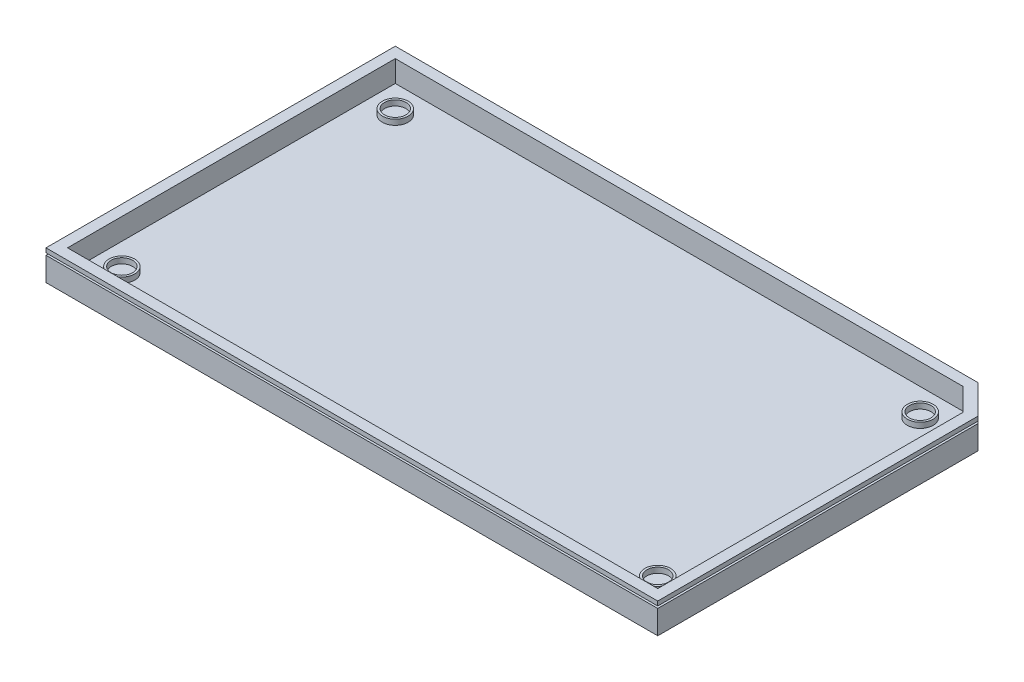
ISO-10303-21;
HEADER;
FILE_DESCRIPTION(('STEP AP214'),'2;1');
FILE_NAME('part.step','',(''),(''),'','','');
FILE_SCHEMA(('AUTOMOTIVE_DESIGN { 1 0 10303 214 1 1 1 1 }'));
ENDSEC;
DATA;
#1=APPLICATION_CONTEXT('core data for automotive mechanical design processes');
#2=APPLICATION_PROTOCOL_DEFINITION('international standard','automotive_design',2000,#1);
#3=PRODUCT_CONTEXT('',#1,'mechanical');
#4=PRODUCT('Part','Part','',(#3));
#5=PRODUCT_RELATED_PRODUCT_CATEGORY('part','',(#4));
#6=PRODUCT_DEFINITION_FORMATION('','',#4);
#7=PRODUCT_DEFINITION_CONTEXT('part definition',#1,'design');
#8=PRODUCT_DEFINITION('design','',#6,#7);
#9=PRODUCT_DEFINITION_SHAPE('','',#8);
#10=(LENGTH_UNIT() NAMED_UNIT(*) SI_UNIT(.MILLI.,.METRE.));
#11=(NAMED_UNIT(*) PLANE_ANGLE_UNIT() SI_UNIT($,.RADIAN.));
#12=(NAMED_UNIT(*) SI_UNIT($,.STERADIAN.) SOLID_ANGLE_UNIT());
#13=UNCERTAINTY_MEASURE_WITH_UNIT(LENGTH_MEASURE(1.E-05),#10,'distance_accuracy_value','');
#14=(GEOMETRIC_REPRESENTATION_CONTEXT(3) GLOBAL_UNCERTAINTY_ASSIGNED_CONTEXT((#13)) GLOBAL_UNIT_ASSIGNED_CONTEXT((#10,
#11,#12)) REPRESENTATION_CONTEXT('',''));
#15=CARTESIAN_POINT('',(0.,0.,0.));
#16=DIRECTION('',(0.,0.,1.));
#17=DIRECTION('',(1.,0.,0.));
#18=AXIS2_PLACEMENT_3D('',#15,#16,#17);
#19=CARTESIAN_POINT('',(64.135,1.25,31.75));
#20=DIRECTION('',(0.,1.,0.));
#21=DIRECTION('',(0.,0.,1.));
#22=AXIS2_PLACEMENT_3D('',#19,#20,#21);
#23=PLANE('',#22);
#24=CARTESIAN_POINT('',(64.135,1.25,31.75));
#25=DIRECTION('',(0.,1.,0.));
#26=DIRECTION('',(0.,0.,1.));
#27=AXIS2_PLACEMENT_3D('',#24,#25,#26);
#28=CIRCLE('',#27,3.00000000000001);
#29=CARTESIAN_POINT('',(64.135,1.25,34.75));
#30=VERTEX_POINT('',#29);
#31=EDGE_CURVE('E11',#30,#30,#28,.T.);
#32=ORIENTED_EDGE('',*,*,#31,.T.);
#33=EDGE_LOOP('',(#32));
#34=FACE_BOUND('',#33,.T.);
#35=CARTESIAN_POINT('',(64.135,1.25,31.75));
#36=DIRECTION('',(0.,1.,0.));
#37=DIRECTION('',(0.,0.,1.));
#38=AXIS2_PLACEMENT_3D('',#35,#36,#37);
#39=CIRCLE('',#38,2.50000000000001);
#40=CARTESIAN_POINT('',(64.135,1.25,34.25));
#41=VERTEX_POINT('',#40);
#42=EDGE_CURVE('E51',#41,#41,#39,.T.);
#43=ORIENTED_EDGE('',*,*,#42,.F.);
#44=EDGE_LOOP('',(#43));
#45=FACE_BOUND('',#44,.T.);
#46=ADVANCED_FACE('F40',(#34,#45),#23,.T.);
#47=CARTESIAN_POINT('',(64.135,0.,31.75));
#48=DIRECTION('',(0.,1.,0.));
#49=DIRECTION('',(0.,0.,1.));
#50=AXIS2_PLACEMENT_3D('',#47,#48,#49);
#51=PLANE('',#50);
#52=CARTESIAN_POINT('',(64.135,0.,31.75));
#53=DIRECTION('',(0.,1.,0.));
#54=DIRECTION('',(0.,0.,1.));
#55=AXIS2_PLACEMENT_3D('',#52,#53,#54);
#56=CIRCLE('',#55,3.00000000000001);
#57=CARTESIAN_POINT('',(64.135,0.,34.75));
#58=VERTEX_POINT('',#57);
#59=EDGE_CURVE('E44',#58,#58,#56,.T.);
#60=ORIENTED_EDGE('',*,*,#59,.F.);
#61=EDGE_LOOP('',(#60));
#62=FACE_BOUND('',#61,.T.);
#63=CARTESIAN_POINT('',(64.135,0.,31.75));
#64=DIRECTION('',(0.,1.,0.));
#65=DIRECTION('',(0.,0.,1.));
#66=AXIS2_PLACEMENT_3D('',#63,#64,#65);
#67=CIRCLE('',#66,2.50000000000001);
#68=CARTESIAN_POINT('',(64.135,0.,34.25));
#69=VERTEX_POINT('',#68);
#70=EDGE_CURVE('E53',#69,#69,#67,.T.);
#71=ORIENTED_EDGE('',*,*,#70,.T.);
#72=EDGE_LOOP('',(#71));
#73=FACE_BOUND('',#72,.T.);
#74=ADVANCED_FACE('F63',(#62,#73),#51,.F.);
#75=CARTESIAN_POINT('',(64.135,1.25,31.75));
#76=DIRECTION('',(0.,-1.,0.));
#77=DIRECTION('',(0.,0.,-1.));
#78=AXIS2_PLACEMENT_3D('',#75,#76,#77);
#79=CYLINDRICAL_SURFACE('',#78,3.00000000000001);
#80=ORIENTED_EDGE('',*,*,#31,.F.);
#81=EDGE_LOOP('',(#80));
#82=FACE_BOUND('',#81,.T.);
#83=ORIENTED_EDGE('',*,*,#59,.T.);
#84=EDGE_LOOP('',(#83));
#85=FACE_BOUND('',#84,.T.);
#86=ADVANCED_FACE('F42',(#82,#85),#79,.T.);
#87=CARTESIAN_POINT('',(64.135,1.25,31.75));
#88=DIRECTION('',(0.,-1.,0.));
#89=DIRECTION('',(0.,0.,-1.));
#90=AXIS2_PLACEMENT_3D('',#87,#88,#89);
#91=CYLINDRICAL_SURFACE('',#90,2.50000000000001);
#92=ORIENTED_EDGE('',*,*,#42,.T.);
#93=EDGE_LOOP('',(#92));
#94=FACE_BOUND('',#93,.T.);
#95=ORIENTED_EDGE('',*,*,#70,.F.);
#96=EDGE_LOOP('',(#95));
#97=FACE_BOUND('',#96,.T.);
#98=ADVANCED_FACE('F59',(#94,#97),#91,.F.);
#99=CLOSED_SHELL('',(#46,#74,#86,#98));
#100=MANIFOLD_SOLID_BREP('B2',#99);
#101=CARTESIAN_POINT('',(61.595,1.25,-31.75));
#102=DIRECTION('',(0.,1.,0.));
#103=DIRECTION('',(0.,0.,1.));
#104=AXIS2_PLACEMENT_3D('',#101,#102,#103);
#105=PLANE('',#104);
#106=CARTESIAN_POINT('',(61.595,1.25,-31.75));
#107=DIRECTION('',(0.,1.,0.));
#108=DIRECTION('',(0.,0.,1.));
#109=AXIS2_PLACEMENT_3D('',#106,#107,#108);
#110=CIRCLE('',#109,3.);
#111=CARTESIAN_POINT('',(61.595,1.25,-28.75));
#112=VERTEX_POINT('',#111);
#113=EDGE_CURVE('E39',#112,#112,#110,.T.);
#114=ORIENTED_EDGE('',*,*,#113,.T.);
#115=EDGE_LOOP('',(#114));
#116=FACE_BOUND('',#115,.T.);
#117=CARTESIAN_POINT('',(61.595,1.25,-31.75));
#118=DIRECTION('',(0.,1.,0.));
#119=DIRECTION('',(0.,0.,1.));
#120=AXIS2_PLACEMENT_3D('',#117,#118,#119);
#121=CIRCLE('',#120,2.5);
#122=CARTESIAN_POINT('',(61.595,1.25,-29.25));
#123=VERTEX_POINT('',#122);
#124=EDGE_CURVE('E121',#123,#123,#121,.T.);
#125=ORIENTED_EDGE('',*,*,#124,.F.);
#126=EDGE_LOOP('',(#125));
#127=FACE_BOUND('',#126,.T.);
#128=ADVANCED_FACE('F110',(#116,#127),#105,.T.);
#129=CARTESIAN_POINT('',(61.595,0.,-31.75));
#130=DIRECTION('',(0.,1.,0.));
#131=DIRECTION('',(0.,0.,1.));
#132=AXIS2_PLACEMENT_3D('',#129,#130,#131);
#133=PLANE('',#132);
#134=CARTESIAN_POINT('',(61.595,0.,-31.75));
#135=DIRECTION('',(0.,1.,0.));
#136=DIRECTION('',(0.,0.,1.));
#137=AXIS2_PLACEMENT_3D('',#134,#135,#136);
#138=CIRCLE('',#137,3.);
#139=CARTESIAN_POINT('',(61.595,0.,-28.75));
#140=VERTEX_POINT('',#139);
#141=EDGE_CURVE('E114',#140,#140,#138,.T.);
#142=ORIENTED_EDGE('',*,*,#141,.F.);
#143=EDGE_LOOP('',(#142));
#144=FACE_BOUND('',#143,.T.);
#145=CARTESIAN_POINT('',(61.595,0.,-31.75));
#146=DIRECTION('',(0.,1.,0.));
#147=DIRECTION('',(0.,0.,1.));
#148=AXIS2_PLACEMENT_3D('',#145,#146,#147);
#149=CIRCLE('',#148,2.5);
#150=CARTESIAN_POINT('',(61.595,0.,-29.25));
#151=VERTEX_POINT('',#150);
#152=EDGE_CURVE('E123',#151,#151,#149,.T.);
#153=ORIENTED_EDGE('',*,*,#152,.T.);
#154=EDGE_LOOP('',(#153));
#155=FACE_BOUND('',#154,.T.);
#156=ADVANCED_FACE('F133',(#144,#155),#133,.F.);
#157=CARTESIAN_POINT('',(61.595,1.25,-31.75));
#158=DIRECTION('',(0.,-1.,0.));
#159=DIRECTION('',(0.,0.,-1.));
#160=AXIS2_PLACEMENT_3D('',#157,#158,#159);
#161=CYLINDRICAL_SURFACE('',#160,3.);
#162=ORIENTED_EDGE('',*,*,#113,.F.);
#163=EDGE_LOOP('',(#162));
#164=FACE_BOUND('',#163,.T.);
#165=ORIENTED_EDGE('',*,*,#141,.T.);
#166=EDGE_LOOP('',(#165));
#167=FACE_BOUND('',#166,.T.);
#168=ADVANCED_FACE('F112',(#164,#167),#161,.T.);
#169=CARTESIAN_POINT('',(61.595,1.25,-31.75));
#170=DIRECTION('',(0.,-1.,0.));
#171=DIRECTION('',(0.,0.,-1.));
#172=AXIS2_PLACEMENT_3D('',#169,#170,#171);
#173=CYLINDRICAL_SURFACE('',#172,2.5);
#174=ORIENTED_EDGE('',*,*,#124,.T.);
#175=EDGE_LOOP('',(#174));
#176=FACE_BOUND('',#175,.T.);
#177=ORIENTED_EDGE('',*,*,#152,.F.);
#178=EDGE_LOOP('',(#177));
#179=FACE_BOUND('',#178,.T.);
#180=ADVANCED_FACE('F129',(#176,#179),#173,.F.);
#181=CLOSED_SHELL('',(#128,#156,#168,#180));
#182=MANIFOLD_SOLID_BREP('B6',#181);
#183=CARTESIAN_POINT('',(-60.325,1.25,-31.75));
#184=DIRECTION('',(0.,1.,0.));
#185=DIRECTION('',(0.,0.,1.));
#186=AXIS2_PLACEMENT_3D('',#183,#184,#185);
#187=PLANE('',#186);
#188=CARTESIAN_POINT('',(-60.325,1.25,-31.75));
#189=DIRECTION('',(0.,1.,0.));
#190=DIRECTION('',(0.,0.,1.));
#191=AXIS2_PLACEMENT_3D('',#188,#189,#190);
#192=CIRCLE('',#191,3.);
#193=CARTESIAN_POINT('',(-60.325,1.25,-28.75));
#194=VERTEX_POINT('',#193);
#195=EDGE_CURVE('E109',#194,#194,#192,.T.);
#196=ORIENTED_EDGE('',*,*,#195,.T.);
#197=EDGE_LOOP('',(#196));
#198=FACE_BOUND('',#197,.T.);
#199=CARTESIAN_POINT('',(-60.325,1.25,-31.75));
#200=DIRECTION('',(0.,1.,0.));
#201=DIRECTION('',(0.,0.,1.));
#202=AXIS2_PLACEMENT_3D('',#199,#200,#201);
#203=CIRCLE('',#202,2.50000000000001);
#204=CARTESIAN_POINT('',(-60.325,1.25,-29.25));
#205=VERTEX_POINT('',#204);
#206=EDGE_CURVE('E191',#205,#205,#203,.T.);
#207=ORIENTED_EDGE('',*,*,#206,.F.);
#208=EDGE_LOOP('',(#207));
#209=FACE_BOUND('',#208,.T.);
#210=ADVANCED_FACE('F180',(#198,#209),#187,.T.);
#211=CARTESIAN_POINT('',(-60.325,0.,-31.75));
#212=DIRECTION('',(0.,1.,0.));
#213=DIRECTION('',(0.,0.,1.));
#214=AXIS2_PLACEMENT_3D('',#211,#212,#213);
#215=PLANE('',#214);
#216=CARTESIAN_POINT('',(-60.325,0.,-31.75));
#217=DIRECTION('',(0.,1.,0.));
#218=DIRECTION('',(0.,0.,1.));
#219=AXIS2_PLACEMENT_3D('',#216,#217,#218);
#220=CIRCLE('',#219,3.);
#221=CARTESIAN_POINT('',(-60.325,0.,-28.75));
#222=VERTEX_POINT('',#221);
#223=EDGE_CURVE('E184',#222,#222,#220,.T.);
#224=ORIENTED_EDGE('',*,*,#223,.F.);
#225=EDGE_LOOP('',(#224));
#226=FACE_BOUND('',#225,.T.);
#227=CARTESIAN_POINT('',(-60.325,0.,-31.75));
#228=DIRECTION('',(0.,1.,0.));
#229=DIRECTION('',(0.,0.,1.));
#230=AXIS2_PLACEMENT_3D('',#227,#228,#229);
#231=CIRCLE('',#230,2.50000000000001);
#232=CARTESIAN_POINT('',(-60.325,0.,-29.25));
#233=VERTEX_POINT('',#232);
#234=EDGE_CURVE('E193',#233,#233,#231,.T.);
#235=ORIENTED_EDGE('',*,*,#234,.T.);
#236=EDGE_LOOP('',(#235));
#237=FACE_BOUND('',#236,.T.);
#238=ADVANCED_FACE('F203',(#226,#237),#215,.F.);
#239=CARTESIAN_POINT('',(-60.325,1.25,-31.75));
#240=DIRECTION('',(0.,-1.,0.));
#241=DIRECTION('',(0.,0.,-1.));
#242=AXIS2_PLACEMENT_3D('',#239,#240,#241);
#243=CYLINDRICAL_SURFACE('',#242,3.);
#244=ORIENTED_EDGE('',*,*,#195,.F.);
#245=EDGE_LOOP('',(#244));
#246=FACE_BOUND('',#245,.T.);
#247=ORIENTED_EDGE('',*,*,#223,.T.);
#248=EDGE_LOOP('',(#247));
#249=FACE_BOUND('',#248,.T.);
#250=ADVANCED_FACE('F182',(#246,#249),#243,.T.);
#251=CARTESIAN_POINT('',(-60.325,1.25,-31.75));
#252=DIRECTION('',(0.,-1.,0.));
#253=DIRECTION('',(0.,0.,-1.));
#254=AXIS2_PLACEMENT_3D('',#251,#252,#253);
#255=CYLINDRICAL_SURFACE('',#254,2.50000000000001);
#256=ORIENTED_EDGE('',*,*,#206,.T.);
#257=EDGE_LOOP('',(#256));
#258=FACE_BOUND('',#257,.T.);
#259=ORIENTED_EDGE('',*,*,#234,.F.);
#260=EDGE_LOOP('',(#259));
#261=FACE_BOUND('',#260,.T.);
#262=ADVANCED_FACE('F199',(#258,#261),#255,.F.);
#263=CLOSED_SHELL('',(#210,#238,#250,#262));
#264=MANIFOLD_SOLID_BREP('B34',#263);
#265=CARTESIAN_POINT('',(-60.325,1.25,31.75));
#266=DIRECTION('',(0.,1.,0.));
#267=DIRECTION('',(0.,0.,1.));
#268=AXIS2_PLACEMENT_3D('',#265,#266,#267);
#269=PLANE('',#268);
#270=CARTESIAN_POINT('',(-60.325,1.25,31.75));
#271=DIRECTION('',(0.,1.,0.));
#272=DIRECTION('',(0.,0.,1.));
#273=AXIS2_PLACEMENT_3D('',#270,#271,#272);
#274=CIRCLE('',#273,3.);
#275=CARTESIAN_POINT('',(-60.325,1.25,34.75));
#276=VERTEX_POINT('',#275);
#277=EDGE_CURVE('E179',#276,#276,#274,.T.);
#278=ORIENTED_EDGE('',*,*,#277,.T.);
#279=EDGE_LOOP('',(#278));
#280=FACE_BOUND('',#279,.T.);
#281=CARTESIAN_POINT('',(-60.325,1.25,31.75));
#282=DIRECTION('',(0.,1.,0.));
#283=DIRECTION('',(0.,0.,1.));
#284=AXIS2_PLACEMENT_3D('',#281,#282,#283);
#285=CIRCLE('',#284,2.5);
#286=CARTESIAN_POINT('',(-60.325,1.25,34.25));
#287=VERTEX_POINT('',#286);
#288=EDGE_CURVE('E262',#287,#287,#285,.T.);
#289=ORIENTED_EDGE('',*,*,#288,.F.);
#290=EDGE_LOOP('',(#289));
#291=FACE_BOUND('',#290,.T.);
#292=ADVANCED_FACE('F251',(#280,#291),#269,.T.);
#293=CARTESIAN_POINT('',(-60.325,0.,31.75));
#294=DIRECTION('',(0.,1.,0.));
#295=DIRECTION('',(0.,0.,1.));
#296=AXIS2_PLACEMENT_3D('',#293,#294,#295);
#297=PLANE('',#296);
#298=CARTESIAN_POINT('',(-60.325,0.,31.75));
#299=DIRECTION('',(0.,1.,0.));
#300=DIRECTION('',(0.,0.,1.));
#301=AXIS2_PLACEMENT_3D('',#298,#299,#300);
#302=CIRCLE('',#301,3.);
#303=CARTESIAN_POINT('',(-60.325,0.,34.75));
#304=VERTEX_POINT('',#303);
#305=EDGE_CURVE('E255',#304,#304,#302,.T.);
#306=ORIENTED_EDGE('',*,*,#305,.F.);
#307=EDGE_LOOP('',(#306));
#308=FACE_BOUND('',#307,.T.);
#309=CARTESIAN_POINT('',(-60.325,0.,31.75));
#310=DIRECTION('',(0.,1.,0.));
#311=DIRECTION('',(0.,0.,1.));
#312=AXIS2_PLACEMENT_3D('',#309,#310,#311);
#313=CIRCLE('',#312,2.5);
#314=CARTESIAN_POINT('',(-60.325,0.,34.25));
#315=VERTEX_POINT('',#314);
#316=EDGE_CURVE('E264',#315,#315,#313,.T.);
#317=ORIENTED_EDGE('',*,*,#316,.T.);
#318=EDGE_LOOP('',(#317));
#319=FACE_BOUND('',#318,.T.);
#320=ADVANCED_FACE('F274',(#308,#319),#297,.F.);
#321=CARTESIAN_POINT('',(-60.325,1.25,31.75));
#322=DIRECTION('',(0.,-1.,0.));
#323=DIRECTION('',(0.,0.,-1.));
#324=AXIS2_PLACEMENT_3D('',#321,#322,#323);
#325=CYLINDRICAL_SURFACE('',#324,3.);
#326=ORIENTED_EDGE('',*,*,#277,.F.);
#327=EDGE_LOOP('',(#326));
#328=FACE_BOUND('',#327,.T.);
#329=ORIENTED_EDGE('',*,*,#305,.T.);
#330=EDGE_LOOP('',(#329));
#331=FACE_BOUND('',#330,.T.);
#332=ADVANCED_FACE('F253',(#328,#331),#325,.T.);
#333=CARTESIAN_POINT('',(-60.325,1.25,31.75));
#334=DIRECTION('',(0.,-1.,0.));
#335=DIRECTION('',(0.,0.,-1.));
#336=AXIS2_PLACEMENT_3D('',#333,#334,#335);
#337=CYLINDRICAL_SURFACE('',#336,2.5);
#338=ORIENTED_EDGE('',*,*,#288,.T.);
#339=EDGE_LOOP('',(#338));
#340=FACE_BOUND('',#339,.T.);
#341=ORIENTED_EDGE('',*,*,#316,.F.);
#342=EDGE_LOOP('',(#341));
#343=FACE_BOUND('',#342,.T.);
#344=ADVANCED_FACE('F270',(#340,#343),#337,.F.);
#345=CLOSED_SHELL('',(#292,#320,#332,#344));
#346=MANIFOLD_SOLID_BREP('B104',#345);
#347=CARTESIAN_POINT('',(0.,5.,0.));
#348=DIRECTION('',(0.,1.,0.));
#349=DIRECTION('',(0.,0.,1.));
#350=AXIS2_PLACEMENT_3D('',#347,#348,#349);
#351=PLANE('',#350);
#352=DIRECTION('',(0.,0.,-1.));
#353=VECTOR('',#352,1.);
#354=CARTESIAN_POINT('',(72.945,5.,40.56));
#355=LINE('',#354,#353);
#356=CARTESIAN_POINT('',(72.945,5.,40.56));
#357=VERTEX_POINT('',#356);
#358=CARTESIAN_POINT('',(72.945,5.,-33.8210678118655));
#359=VERTEX_POINT('',#358);
#360=EDGE_CURVE('E554',#357,#359,#355,.T.);
#361=ORIENTED_EDGE('',*,*,#360,.T.);
#362=DIRECTION('',(-0.707106781186548,0.,-0.707106781186547));
#363=VECTOR('',#362,1.);
#364=CARTESIAN_POINT('',(72.945,5.,-33.8210678118655));
#365=LINE('',#364,#363);
#366=CARTESIAN_POINT('',(66.2060678118655,5.,-40.56));
#367=VERTEX_POINT('',#366);
#368=EDGE_CURVE('E557',#359,#367,#365,.T.);
#369=ORIENTED_EDGE('',*,*,#368,.T.);
#370=DIRECTION('',(-1.,0.,0.));
#371=VECTOR('',#370,1.);
#372=CARTESIAN_POINT('',(66.2060678118655,5.,-40.56));
#373=LINE('',#372,#371);
#374=CARTESIAN_POINT('',(-69.135,5.,-40.56));
#375=VERTEX_POINT('',#374);
#376=EDGE_CURVE('E560',#367,#375,#373,.T.);
#377=ORIENTED_EDGE('',*,*,#376,.T.);
#378=DIRECTION('',(0.,0.,1.));
#379=VECTOR('',#378,1.);
#380=CARTESIAN_POINT('',(-69.135,5.,-40.56));
#381=LINE('',#380,#379);
#382=CARTESIAN_POINT('',(-69.135,5.,40.56));
#383=VERTEX_POINT('',#382);
#384=EDGE_CURVE('E563',#375,#383,#381,.T.);
#385=ORIENTED_EDGE('',*,*,#384,.T.);
#386=DIRECTION('',(1.,0.,0.));
#387=VECTOR('',#386,1.);
#388=CARTESIAN_POINT('',(-69.135,5.,40.56));
#389=LINE('',#388,#387);
#390=EDGE_CURVE('E566',#383,#357,#389,.T.);
#391=ORIENTED_EDGE('',*,*,#390,.T.);
#392=EDGE_LOOP('',(#361,#369,#377,#385,#391));
#393=FACE_BOUND('',#392,.T.);
#394=DIRECTION('',(1.,0.,0.));
#395=VECTOR('',#394,1.);
#396=CARTESIAN_POINT('',(-66.635,5.,38.06));
#397=LINE('',#396,#395);
#398=CARTESIAN_POINT('',(-66.635,5.,38.06));
#399=VERTEX_POINT('',#398);
#400=CARTESIAN_POINT('',(70.445,5.,38.06));
#401=VERTEX_POINT('',#400);
#402=EDGE_CURVE('E520',#399,#401,#397,.T.);
#403=ORIENTED_EDGE('',*,*,#402,.F.);
#404=DIRECTION('',(0.,0.,1.));
#405=VECTOR('',#404,1.);
#406=CARTESIAN_POINT('',(-66.635,5.,-38.06));
#407=LINE('',#406,#405);
#408=CARTESIAN_POINT('',(-66.635,5.,-38.06));
#409=VERTEX_POINT('',#408);
#410=EDGE_CURVE('E518',#409,#399,#407,.T.);
#411=ORIENTED_EDGE('',*,*,#410,.F.);
#412=DIRECTION('',(-1.,0.,0.));
#413=VECTOR('',#412,1.);
#414=CARTESIAN_POINT('',(65.1705339059328,5.,-38.06));
#415=LINE('',#414,#413);
#416=CARTESIAN_POINT('',(65.1705339059328,5.,-38.06));
#417=VERTEX_POINT('',#416);
#418=EDGE_CURVE('E528',#417,#409,#415,.T.);
#419=ORIENTED_EDGE('',*,*,#418,.F.);
#420=DIRECTION('',(-0.707106781186547,0.,-0.707106781186547));
#421=VECTOR('',#420,1.);
#422=CARTESIAN_POINT('',(70.445,5.,-32.7855339059328));
#423=LINE('',#422,#421);
#424=CARTESIAN_POINT('',(70.445,5.,-32.7855339059328));
#425=VERTEX_POINT('',#424);
#426=EDGE_CURVE('E525',#425,#417,#423,.T.);
#427=ORIENTED_EDGE('',*,*,#426,.F.);
#428=DIRECTION('',(0.,0.,-1.));
#429=VECTOR('',#428,1.);
#430=CARTESIAN_POINT('',(70.445,5.,38.06));
#431=LINE('',#430,#429);
#432=EDGE_CURVE('E523',#401,#425,#431,.T.);
#433=ORIENTED_EDGE('',*,*,#432,.F.);
#434=EDGE_LOOP('',(#403,#411,#419,#427,#433));
#435=FACE_BOUND('',#434,.T.);
#436=ADVANCED_FACE('F313',(#393,#435),#351,.T.);
#437=CARTESIAN_POINT('',(72.945,-2.,40.56));
#438=DIRECTION('',(1.,0.,0.));
#439=DIRECTION('',(0.,0.,-1.));
#440=AXIS2_PLACEMENT_3D('',#437,#438,#439);
#441=PLANE('',#440);
#442=DIRECTION('',(0.,0.,1.));
#443=VECTOR('',#442,1.);
#444=CARTESIAN_POINT('',(72.945,4.,40.56));
#445=LINE('',#444,#443);
#446=CARTESIAN_POINT('',(72.945,4.,-33.8210678118655));
#447=VERTEX_POINT('',#446);
#448=CARTESIAN_POINT('',(72.945,4.,40.56));
#449=VERTEX_POINT('',#448);
#450=EDGE_CURVE('E505',#447,#449,#445,.T.);
#451=ORIENTED_EDGE('',*,*,#450,.F.);
#452=DIRECTION('',(0.,1.,0.));
#453=VECTOR('',#452,1.);
#454=CARTESIAN_POINT('',(72.945,-2.,-33.8210678118655));
#455=LINE('',#454,#453);
#456=EDGE_CURVE('E584',#447,#359,#455,.T.);
#457=ORIENTED_EDGE('',*,*,#456,.T.);
#458=ORIENTED_EDGE('',*,*,#360,.F.);
#459=DIRECTION('',(0.,1.,0.));
#460=VECTOR('',#459,1.);
#461=CARTESIAN_POINT('',(72.945,-2.,40.56));
#462=LINE('',#461,#460);
#463=EDGE_CURVE('E588',#449,#357,#462,.T.);
#464=ORIENTED_EDGE('',*,*,#463,.F.);
#465=EDGE_LOOP('',(#451,#457,#458,#464));
#466=FACE_BOUND('',#465,.T.);
#467=ADVANCED_FACE('F315',(#466),#441,.T.);
#468=CARTESIAN_POINT('',(-69.135,-2.,40.56));
#469=DIRECTION('',(0.,0.,1.));
#470=DIRECTION('',(1.,0.,0.));
#471=AXIS2_PLACEMENT_3D('',#468,#469,#470);
#472=PLANE('',#471);
#473=DIRECTION('',(-1.,0.,0.));
#474=VECTOR('',#473,1.);
#475=CARTESIAN_POINT('',(-69.135,4.,40.56));
#476=LINE('',#475,#474);
#477=CARTESIAN_POINT('',(-69.135,4.,40.56));
#478=VERTEX_POINT('',#477);
#479=EDGE_CURVE('E503',#449,#478,#476,.T.);
#480=ORIENTED_EDGE('',*,*,#479,.F.);
#481=ORIENTED_EDGE('',*,*,#463,.T.);
#482=ORIENTED_EDGE('',*,*,#390,.F.);
#483=DIRECTION('',(0.,1.,0.));
#484=VECTOR('',#483,1.);
#485=CARTESIAN_POINT('',(-69.135,-2.,40.56));
#486=LINE('',#485,#484);
#487=EDGE_CURVE('E592',#478,#383,#486,.T.);
#488=ORIENTED_EDGE('',*,*,#487,.F.);
#489=EDGE_LOOP('',(#480,#481,#482,#488));
#490=FACE_BOUND('',#489,.T.);
#491=ADVANCED_FACE('F622',(#490),#472,.T.);
#492=CARTESIAN_POINT('',(-69.135,-2.,-40.56));
#493=DIRECTION('',(-1.,0.,0.));
#494=DIRECTION('',(0.,0.,1.));
#495=AXIS2_PLACEMENT_3D('',#492,#493,#494);
#496=PLANE('',#495);
#497=DIRECTION('',(0.,0.,-1.));
#498=VECTOR('',#497,1.);
#499=CARTESIAN_POINT('',(-69.135,4.,-40.56));
#500=LINE('',#499,#498);
#501=CARTESIAN_POINT('',(-69.135,4.,-40.56));
#502=VERTEX_POINT('',#501);
#503=EDGE_CURVE('E501',#478,#502,#500,.T.);
#504=ORIENTED_EDGE('',*,*,#503,.F.);
#505=ORIENTED_EDGE('',*,*,#487,.T.);
#506=ORIENTED_EDGE('',*,*,#384,.F.);
#507=DIRECTION('',(0.,1.,0.));
#508=VECTOR('',#507,1.);
#509=CARTESIAN_POINT('',(-69.135,-2.,-40.56));
#510=LINE('',#509,#508);
#511=EDGE_CURVE('E596',#502,#375,#510,.T.);
#512=ORIENTED_EDGE('',*,*,#511,.F.);
#513=EDGE_LOOP('',(#504,#505,#506,#512));
#514=FACE_BOUND('',#513,.T.);
#515=ADVANCED_FACE('F626',(#514),#496,.T.);
#516=CARTESIAN_POINT('',(66.2060678118655,-2.,-40.56));
#517=DIRECTION('',(0.,0.,-1.));
#518=DIRECTION('',(-1.,0.,0.));
#519=AXIS2_PLACEMENT_3D('',#516,#517,#518);
#520=PLANE('',#519);
#521=DIRECTION('',(1.,0.,0.));
#522=VECTOR('',#521,1.);
#523=CARTESIAN_POINT('',(66.2060678118655,4.,-40.56));
#524=LINE('',#523,#522);
#525=CARTESIAN_POINT('',(66.2060678118655,4.,-40.56));
#526=VERTEX_POINT('',#525);
#527=EDGE_CURVE('E335',#502,#526,#524,.T.);
#528=ORIENTED_EDGE('',*,*,#527,.F.);
#529=ORIENTED_EDGE('',*,*,#511,.T.);
#530=ORIENTED_EDGE('',*,*,#376,.F.);
#531=DIRECTION('',(0.,1.,0.));
#532=VECTOR('',#531,1.);
#533=CARTESIAN_POINT('',(66.2060678118655,-2.,-40.56));
#534=LINE('',#533,#532);
#535=EDGE_CURVE('E600',#526,#367,#534,.T.);
#536=ORIENTED_EDGE('',*,*,#535,.F.);
#537=EDGE_LOOP('',(#528,#529,#530,#536));
#538=FACE_BOUND('',#537,.T.);
#539=ADVANCED_FACE('F628',(#538),#520,.T.);
#540=CARTESIAN_POINT('',(72.945,-2.,-33.8210678118655));
#541=DIRECTION('',(0.707106781186547,0.,-0.707106781186548));
#542=DIRECTION('',(-0.707106781186548,0.,-0.707106781186547));
#543=AXIS2_PLACEMENT_3D('',#540,#541,#542);
#544=PLANE('',#543);
#545=DIRECTION('',(0.707106781186548,0.,0.707106781186547));
#546=VECTOR('',#545,1.);
#547=CARTESIAN_POINT('',(72.945,4.,-33.8210678118655));
#548=LINE('',#547,#546);
#549=EDGE_CURVE('E321',#526,#447,#548,.T.);
#550=ORIENTED_EDGE('',*,*,#549,.F.);
#551=ORIENTED_EDGE('',*,*,#535,.T.);
#552=ORIENTED_EDGE('',*,*,#368,.F.);
#553=ORIENTED_EDGE('',*,*,#456,.F.);
#554=EDGE_LOOP('',(#550,#551,#552,#553));
#555=FACE_BOUND('',#554,.T.);
#556=ADVANCED_FACE('F614',(#555),#544,.T.);
#557=CARTESIAN_POINT('',(-66.635,5.,-38.06));
#558=DIRECTION('',(1.,0.,0.));
#559=DIRECTION('',(0.,0.,-1.));
#560=AXIS2_PLACEMENT_3D('',#557,#558,#559);
#561=PLANE('',#560);
#562=DIRECTION('',(0.,0.,1.));
#563=VECTOR('',#562,1.);
#564=CARTESIAN_POINT('',(-66.635,0.,-38.06));
#565=LINE('',#564,#563);
#566=CARTESIAN_POINT('',(-66.635,0.,-38.06));
#567=VERTEX_POINT('',#566);
#568=CARTESIAN_POINT('',(-66.635,0.,38.06));
#569=VERTEX_POINT('',#568);
#570=EDGE_CURVE('E517',#567,#569,#565,.T.);
#571=ORIENTED_EDGE('',*,*,#570,.F.);
#572=DIRECTION('',(0.,-1.,0.));
#573=VECTOR('',#572,1.);
#574=CARTESIAN_POINT('',(-66.635,5.,-38.06));
#575=LINE('',#574,#573);
#576=EDGE_CURVE('E530',#409,#567,#575,.T.);
#577=ORIENTED_EDGE('',*,*,#576,.F.);
#578=ORIENTED_EDGE('',*,*,#410,.T.);
#579=DIRECTION('',(0.,-1.,0.));
#580=VECTOR('',#579,1.);
#581=CARTESIAN_POINT('',(-66.635,5.,38.06));
#582=LINE('',#581,#580);
#583=EDGE_CURVE('E551',#399,#569,#582,.T.);
#584=ORIENTED_EDGE('',*,*,#583,.T.);
#585=EDGE_LOOP('',(#571,#577,#578,#584));
#586=FACE_BOUND('',#585,.T.);
#587=ADVANCED_FACE('F636',(#586),#561,.T.);
#588=CARTESIAN_POINT('',(-66.635,5.,38.06));
#589=DIRECTION('',(0.,0.,-1.));
#590=DIRECTION('',(-1.,0.,0.));
#591=AXIS2_PLACEMENT_3D('',#588,#589,#590);
#592=PLANE('',#591);
#593=DIRECTION('',(1.,0.,0.));
#594=VECTOR('',#593,1.);
#595=CARTESIAN_POINT('',(-66.635,0.,38.06));
#596=LINE('',#595,#594);
#597=CARTESIAN_POINT('',(70.445,0.,38.06));
#598=VERTEX_POINT('',#597);
#599=EDGE_CURVE('E533',#569,#598,#596,.T.);
#600=ORIENTED_EDGE('',*,*,#599,.F.);
#601=ORIENTED_EDGE('',*,*,#583,.F.);
#602=ORIENTED_EDGE('',*,*,#402,.T.);
#603=DIRECTION('',(0.,-1.,0.));
#604=VECTOR('',#603,1.);
#605=CARTESIAN_POINT('',(70.445,5.,38.06));
#606=LINE('',#605,#604);
#607=EDGE_CURVE('E548',#401,#598,#606,.T.);
#608=ORIENTED_EDGE('',*,*,#607,.T.);
#609=EDGE_LOOP('',(#600,#601,#602,#608));
#610=FACE_BOUND('',#609,.T.);
#611=ADVANCED_FACE('F696',(#610),#592,.T.);
#612=CARTESIAN_POINT('',(70.445,5.,38.06));
#613=DIRECTION('',(-1.,0.,0.));
#614=DIRECTION('',(0.,0.,1.));
#615=AXIS2_PLACEMENT_3D('',#612,#613,#614);
#616=PLANE('',#615);
#617=DIRECTION('',(0.,0.,-1.));
#618=VECTOR('',#617,1.);
#619=CARTESIAN_POINT('',(70.445,0.,38.06));
#620=LINE('',#619,#618);
#621=CARTESIAN_POINT('',(70.445,0.,-32.7855339059328));
#622=VERTEX_POINT('',#621);
#623=EDGE_CURVE('E535',#598,#622,#620,.T.);
#624=ORIENTED_EDGE('',*,*,#623,.F.);
#625=ORIENTED_EDGE('',*,*,#607,.F.);
#626=ORIENTED_EDGE('',*,*,#432,.T.);
#627=DIRECTION('',(0.,-1.,0.));
#628=VECTOR('',#627,1.);
#629=CARTESIAN_POINT('',(70.445,5.,-32.7855339059328));
#630=LINE('',#629,#628);
#631=EDGE_CURVE('E545',#425,#622,#630,.T.);
#632=ORIENTED_EDGE('',*,*,#631,.T.);
#633=EDGE_LOOP('',(#624,#625,#626,#632));
#634=FACE_BOUND('',#633,.T.);
#635=ADVANCED_FACE('F693',(#634),#616,.T.);
#636=CARTESIAN_POINT('',(70.445,5.,-32.7855339059328));
#637=DIRECTION('',(-0.707106781186548,0.,0.707106781186548));
#638=DIRECTION('',(0.707106781186548,0.,0.707106781186548));
#639=AXIS2_PLACEMENT_3D('',#636,#637,#638);
#640=PLANE('',#639);
#641=DIRECTION('',(-0.707106781186547,0.,-0.707106781186547));
#642=VECTOR('',#641,1.);
#643=CARTESIAN_POINT('',(70.445,0.,-32.7855339059328));
#644=LINE('',#643,#642);
#645=CARTESIAN_POINT('',(65.1705339059328,0.,-38.06));
#646=VERTEX_POINT('',#645);
#647=EDGE_CURVE('E537',#622,#646,#644,.T.);
#648=ORIENTED_EDGE('',*,*,#647,.F.);
#649=ORIENTED_EDGE('',*,*,#631,.F.);
#650=ORIENTED_EDGE('',*,*,#426,.T.);
#651=DIRECTION('',(0.,-1.,0.));
#652=VECTOR('',#651,1.);
#653=CARTESIAN_POINT('',(65.1705339059328,5.,-38.06));
#654=LINE('',#653,#652);
#655=EDGE_CURVE('E542',#417,#646,#654,.T.);
#656=ORIENTED_EDGE('',*,*,#655,.T.);
#657=EDGE_LOOP('',(#648,#649,#650,#656));
#658=FACE_BOUND('',#657,.T.);
#659=ADVANCED_FACE('F689',(#658),#640,.T.);
#660=CARTESIAN_POINT('',(65.1705339059328,5.,-38.06));
#661=DIRECTION('',(0.,0.,1.));
#662=DIRECTION('',(1.,0.,0.));
#663=AXIS2_PLACEMENT_3D('',#660,#661,#662);
#664=PLANE('',#663);
#665=DIRECTION('',(-1.,0.,0.));
#666=VECTOR('',#665,1.);
#667=CARTESIAN_POINT('',(65.1705339059328,0.,-38.06));
#668=LINE('',#667,#666);
#669=EDGE_CURVE('E521',#646,#567,#668,.T.);
#670=ORIENTED_EDGE('',*,*,#669,.F.);
#671=ORIENTED_EDGE('',*,*,#655,.F.);
#672=ORIENTED_EDGE('',*,*,#418,.T.);
#673=ORIENTED_EDGE('',*,*,#576,.T.);
#674=EDGE_LOOP('',(#670,#671,#672,#673));
#675=FACE_BOUND('',#674,.T.);
#676=ADVANCED_FACE('F681',(#675),#664,.T.);
#677=CARTESIAN_POINT('',(0.,0.,0.));
#678=DIRECTION('',(0.,1.,0.));
#679=DIRECTION('',(0.,0.,1.));
#680=AXIS2_PLACEMENT_3D('',#677,#678,#679);
#681=PLANE('',#680);
#682=ORIENTED_EDGE('',*,*,#570,.T.);
#683=ORIENTED_EDGE('',*,*,#599,.T.);
#684=ORIENTED_EDGE('',*,*,#623,.T.);
#685=ORIENTED_EDGE('',*,*,#647,.T.);
#686=ORIENTED_EDGE('',*,*,#669,.T.);
#687=EDGE_LOOP('',(#682,#683,#684,#685,#686));
#688=FACE_BOUND('',#687,.T.);
#689=ADVANCED_FACE('F674',(#688),#681,.T.);
#690=CARTESIAN_POINT('',(0.,3.5,0.));
#691=DIRECTION('',(0.,1.,0.));
#692=DIRECTION('',(0.,0.,1.));
#693=AXIS2_PLACEMENT_3D('',#690,#691,#692);
#694=PLANE('',#693);
#695=DIRECTION('',(0.707106781186548,0.,0.707106781186547));
#696=VECTOR('',#695,1.);
#697=CARTESIAN_POINT('',(72.945,3.5,-33.8210678118655));
#698=LINE('',#697,#696);
#699=CARTESIAN_POINT('',(66.2060678118655,3.5,-40.56));
#700=VERTEX_POINT('',#699);
#701=CARTESIAN_POINT('',(72.945,3.5,-33.8210678118655));
#702=VERTEX_POINT('',#701);
#703=EDGE_CURVE('E249',#700,#702,#698,.T.);
#704=ORIENTED_EDGE('',*,*,#703,.F.);
#705=DIRECTION('',(1.,0.,0.));
#706=VECTOR('',#705,1.);
#707=CARTESIAN_POINT('',(66.2060678118655,3.5,-40.56));
#708=LINE('',#707,#706);
#709=CARTESIAN_POINT('',(-69.135,3.5,-40.56));
#710=VERTEX_POINT('',#709);
#711=EDGE_CURVE('E507',#710,#700,#708,.T.);
#712=ORIENTED_EDGE('',*,*,#711,.F.);
#713=DIRECTION('',(0.,0.,-1.));
#714=VECTOR('',#713,1.);
#715=CARTESIAN_POINT('',(-69.135,3.5,-40.56));
#716=LINE('',#715,#714);
#717=CARTESIAN_POINT('',(-69.135,3.5,40.56));
#718=VERTEX_POINT('',#717);
#719=EDGE_CURVE('E510',#718,#710,#716,.T.);
#720=ORIENTED_EDGE('',*,*,#719,.F.);
#721=DIRECTION('',(-1.,0.,0.));
#722=VECTOR('',#721,1.);
#723=CARTESIAN_POINT('',(-69.135,3.5,40.56));
#724=LINE('',#723,#722);
#725=CARTESIAN_POINT('',(72.945,3.5,40.56));
#726=VERTEX_POINT('',#725);
#727=EDGE_CURVE('E513',#726,#718,#724,.T.);
#728=ORIENTED_EDGE('',*,*,#727,.F.);
#729=DIRECTION('',(0.,0.,1.));
#730=VECTOR('',#729,1.);
#731=CARTESIAN_POINT('',(72.945,3.5,40.56));
#732=LINE('',#731,#730);
#733=EDGE_CURVE('E328',#702,#726,#732,.T.);
#734=ORIENTED_EDGE('',*,*,#733,.F.);
#735=EDGE_LOOP('',(#704,#712,#720,#728,#734));
#736=FACE_BOUND('',#735,.T.);
#737=DIRECTION('',(-0.707106781186548,0.,-0.707106781186547));
#738=VECTOR('',#737,1.);
#739=CARTESIAN_POINT('',(71.945,3.5,-33.4068542494924));
#740=LINE('',#739,#738);
#741=CARTESIAN_POINT('',(71.945,3.5,-33.4068542494924));
#742=VERTEX_POINT('',#741);
#743=CARTESIAN_POINT('',(65.7918542494924,3.5,-39.56));
#744=VERTEX_POINT('',#743);
#745=EDGE_CURVE('E460',#742,#744,#740,.T.);
#746=ORIENTED_EDGE('',*,*,#745,.F.);
#747=DIRECTION('',(0.,0.,-1.));
#748=VECTOR('',#747,1.);
#749=CARTESIAN_POINT('',(71.945,3.5,39.56));
#750=LINE('',#749,#748);
#751=CARTESIAN_POINT('',(71.945,3.5,39.56));
#752=VERTEX_POINT('',#751);
#753=EDGE_CURVE('E482',#752,#742,#750,.T.);
#754=ORIENTED_EDGE('',*,*,#753,.F.);
#755=DIRECTION('',(1.,0.,0.));
#756=VECTOR('',#755,1.);
#757=CARTESIAN_POINT('',(-68.135,3.5,39.56));
#758=LINE('',#757,#756);
#759=CARTESIAN_POINT('',(-68.135,3.5,39.56));
#760=VERTEX_POINT('',#759);
#761=EDGE_CURVE('E470',#760,#752,#758,.T.);
#762=ORIENTED_EDGE('',*,*,#761,.F.);
#763=DIRECTION('',(0.,0.,1.));
#764=VECTOR('',#763,1.);
#765=CARTESIAN_POINT('',(-68.135,3.5,-39.56));
#766=LINE('',#765,#764);
#767=CARTESIAN_POINT('',(-68.135,3.5,-39.56));
#768=VERTEX_POINT('',#767);
#769=EDGE_CURVE('E453',#768,#760,#766,.T.);
#770=ORIENTED_EDGE('',*,*,#769,.F.);
#771=DIRECTION('',(-1.,0.,0.));
#772=VECTOR('',#771,1.);
#773=CARTESIAN_POINT('',(65.7918542494924,3.5,-39.56));
#774=LINE('',#773,#772);
#775=EDGE_CURVE('E466',#744,#768,#774,.T.);
#776=ORIENTED_EDGE('',*,*,#775,.F.);
#777=EDGE_LOOP('',(#746,#754,#762,#770,#776));
#778=FACE_BOUND('',#777,.T.);
#779=ADVANCED_FACE('F465',(#736,#778),#694,.T.);
#780=CARTESIAN_POINT('',(0.,4.,0.));
#781=DIRECTION('',(0.,1.,0.));
#782=DIRECTION('',(0.,0.,1.));
#783=AXIS2_PLACEMENT_3D('',#780,#781,#782);
#784=PLANE('',#783);
#785=ORIENTED_EDGE('',*,*,#450,.T.);
#786=ORIENTED_EDGE('',*,*,#479,.T.);
#787=ORIENTED_EDGE('',*,*,#503,.T.);
#788=ORIENTED_EDGE('',*,*,#527,.T.);
#789=ORIENTED_EDGE('',*,*,#549,.T.);
#790=EDGE_LOOP('',(#785,#786,#787,#788,#789));
#791=FACE_BOUND('',#790,.T.);
#792=DIRECTION('',(-1.,0.,0.));
#793=VECTOR('',#792,1.);
#794=CARTESIAN_POINT('',(65.7918542494924,4.,-39.56));
#795=LINE('',#794,#793);
#796=CARTESIAN_POINT('',(65.7918542494924,4.,-39.56));
#797=VERTEX_POINT('',#796);
#798=CARTESIAN_POINT('',(-68.135,4.,-39.56));
#799=VERTEX_POINT('',#798);
#800=EDGE_CURVE('E486',#797,#799,#795,.T.);
#801=ORIENTED_EDGE('',*,*,#800,.T.);
#802=DIRECTION('',(0.,0.,1.));
#803=VECTOR('',#802,1.);
#804=CARTESIAN_POINT('',(-68.135,4.,-39.56));
#805=LINE('',#804,#803);
#806=CARTESIAN_POINT('',(-68.135,4.,39.56));
#807=VERTEX_POINT('',#806);
#808=EDGE_CURVE('E455',#799,#807,#805,.T.);
#809=ORIENTED_EDGE('',*,*,#808,.T.);
#810=DIRECTION('',(1.,0.,0.));
#811=VECTOR('',#810,1.);
#812=CARTESIAN_POINT('',(-68.135,4.,39.56));
#813=LINE('',#812,#811);
#814=CARTESIAN_POINT('',(71.945,4.,39.56));
#815=VERTEX_POINT('',#814);
#816=EDGE_CURVE('E489',#807,#815,#813,.T.);
#817=ORIENTED_EDGE('',*,*,#816,.T.);
#818=DIRECTION('',(0.,0.,-1.));
#819=VECTOR('',#818,1.);
#820=CARTESIAN_POINT('',(71.945,4.,39.56));
#821=LINE('',#820,#819);
#822=CARTESIAN_POINT('',(71.945,4.,-33.4068542494924));
#823=VERTEX_POINT('',#822);
#824=EDGE_CURVE('E478',#815,#823,#821,.T.);
#825=ORIENTED_EDGE('',*,*,#824,.T.);
#826=DIRECTION('',(-0.707106781186548,0.,-0.707106781186547));
#827=VECTOR('',#826,1.);
#828=CARTESIAN_POINT('',(71.945,4.,-33.4068542494924));
#829=LINE('',#828,#827);
#830=EDGE_CURVE('E475',#823,#797,#829,.T.);
#831=ORIENTED_EDGE('',*,*,#830,.T.);
#832=EDGE_LOOP('',(#801,#809,#817,#825,#831));
#833=FACE_BOUND('',#832,.T.);
#834=ADVANCED_FACE('F604',(#791,#833),#784,.F.);
#835=CARTESIAN_POINT('',(65.7918542494924,3.5,-39.56));
#836=DIRECTION('',(0.,0.,-1.));
#837=DIRECTION('',(-1.,0.,0.));
#838=AXIS2_PLACEMENT_3D('',#835,#836,#837);
#839=PLANE('',#838);
#840=ORIENTED_EDGE('',*,*,#800,.F.);
#841=DIRECTION('',(0.,1.,0.));
#842=VECTOR('',#841,1.);
#843=CARTESIAN_POINT('',(65.7918542494924,3.5,-39.56));
#844=LINE('',#843,#842);
#845=EDGE_CURVE('E474',#744,#797,#844,.T.);
#846=ORIENTED_EDGE('',*,*,#845,.F.);
#847=ORIENTED_EDGE('',*,*,#775,.T.);
#848=DIRECTION('',(0.,1.,0.));
#849=VECTOR('',#848,1.);
#850=CARTESIAN_POINT('',(-68.135,3.5,-39.56));
#851=LINE('',#850,#849);
#852=EDGE_CURVE('E450',#768,#799,#851,.T.);
#853=ORIENTED_EDGE('',*,*,#852,.T.);
#854=EDGE_LOOP('',(#840,#846,#847,#853));
#855=FACE_BOUND('',#854,.T.);
#856=ADVANCED_FACE('F473',(#855),#839,.T.);
#857=CARTESIAN_POINT('',(71.945,3.5,-33.4068542494924));
#858=DIRECTION('',(0.707106781186547,0.,-0.707106781186548));
#859=DIRECTION('',(-0.707106781186548,0.,-0.707106781186547));
#860=AXIS2_PLACEMENT_3D('',#857,#858,#859);
#861=PLANE('',#860);
#862=ORIENTED_EDGE('',*,*,#830,.F.);
#863=DIRECTION('',(0.,1.,0.));
#864=VECTOR('',#863,1.);
#865=CARTESIAN_POINT('',(71.945,3.5,-33.4068542494924));
#866=LINE('',#865,#864);
#867=EDGE_CURVE('E495',#742,#823,#866,.T.);
#868=ORIENTED_EDGE('',*,*,#867,.F.);
#869=ORIENTED_EDGE('',*,*,#745,.T.);
#870=ORIENTED_EDGE('',*,*,#845,.T.);
#871=EDGE_LOOP('',(#862,#868,#869,#870));
#872=FACE_BOUND('',#871,.T.);
#873=ADVANCED_FACE('F747',(#872),#861,.T.);
#874=CARTESIAN_POINT('',(71.945,3.5,39.56));
#875=DIRECTION('',(1.,0.,0.));
#876=DIRECTION('',(0.,0.,-1.));
#877=AXIS2_PLACEMENT_3D('',#874,#875,#876);
#878=PLANE('',#877);
#879=ORIENTED_EDGE('',*,*,#824,.F.);
#880=DIRECTION('',(0.,1.,0.));
#881=VECTOR('',#880,1.);
#882=CARTESIAN_POINT('',(71.945,3.5,39.56));
#883=LINE('',#882,#881);
#884=EDGE_CURVE('E497',#752,#815,#883,.T.);
#885=ORIENTED_EDGE('',*,*,#884,.F.);
#886=ORIENTED_EDGE('',*,*,#753,.T.);
#887=ORIENTED_EDGE('',*,*,#867,.T.);
#888=EDGE_LOOP('',(#879,#885,#886,#887));
#889=FACE_BOUND('',#888,.T.);
#890=ADVANCED_FACE('F755',(#889),#878,.T.);
#891=CARTESIAN_POINT('',(-68.135,3.5,39.56));
#892=DIRECTION('',(0.,0.,1.));
#893=DIRECTION('',(1.,0.,0.));
#894=AXIS2_PLACEMENT_3D('',#891,#892,#893);
#895=PLANE('',#894);
#896=ORIENTED_EDGE('',*,*,#816,.F.);
#897=DIRECTION('',(0.,1.,0.));
#898=VECTOR('',#897,1.);
#899=CARTESIAN_POINT('',(-68.135,3.5,39.56));
#900=LINE('',#899,#898);
#901=EDGE_CURVE('E459',#760,#807,#900,.T.);
#902=ORIENTED_EDGE('',*,*,#901,.F.);
#903=ORIENTED_EDGE('',*,*,#761,.T.);
#904=ORIENTED_EDGE('',*,*,#884,.T.);
#905=EDGE_LOOP('',(#896,#902,#903,#904));
#906=FACE_BOUND('',#905,.T.);
#907=ADVANCED_FACE('F765',(#906),#895,.T.);
#908=CARTESIAN_POINT('',(-68.135,3.5,-39.56));
#909=DIRECTION('',(-1.,0.,0.));
#910=DIRECTION('',(0.,0.,1.));
#911=AXIS2_PLACEMENT_3D('',#908,#909,#910);
#912=PLANE('',#911);
#913=ORIENTED_EDGE('',*,*,#808,.F.);
#914=ORIENTED_EDGE('',*,*,#852,.F.);
#915=ORIENTED_EDGE('',*,*,#769,.T.);
#916=ORIENTED_EDGE('',*,*,#901,.T.);
#917=EDGE_LOOP('',(#913,#914,#915,#916));
#918=FACE_BOUND('',#917,.T.);
#919=ADVANCED_FACE('F452',(#918),#912,.T.);
#920=CARTESIAN_POINT('',(0.,-2.,0.));
#921=DIRECTION('',(0.,1.,0.));
#922=DIRECTION('',(0.,0.,1.));
#923=AXIS2_PLACEMENT_3D('',#920,#921,#922);
#924=PLANE('',#923);
#925=DIRECTION('',(0.,0.,-1.));
#926=VECTOR('',#925,1.);
#927=CARTESIAN_POINT('',(72.945,-2.,40.56));
#928=LINE('',#927,#926);
#929=CARTESIAN_POINT('',(72.945,-2.,40.56));
#930=VERTEX_POINT('',#929);
#931=CARTESIAN_POINT('',(72.945,-2.,-33.8210678118655));
#932=VERTEX_POINT('',#931);
#933=EDGE_CURVE('E569',#930,#932,#928,.T.);
#934=ORIENTED_EDGE('',*,*,#933,.F.);
#935=DIRECTION('',(1.,0.,0.));
#936=VECTOR('',#935,1.);
#937=CARTESIAN_POINT('',(-69.135,-2.,40.56));
#938=LINE('',#937,#936);
#939=CARTESIAN_POINT('',(-69.135,-2.,40.56));
#940=VERTEX_POINT('',#939);
#941=EDGE_CURVE('E581',#940,#930,#938,.T.);
#942=ORIENTED_EDGE('',*,*,#941,.F.);
#943=DIRECTION('',(0.,0.,1.));
#944=VECTOR('',#943,1.);
#945=CARTESIAN_POINT('',(-69.135,-2.,-40.56));
#946=LINE('',#945,#944);
#947=CARTESIAN_POINT('',(-69.135,-2.,-40.56));
#948=VERTEX_POINT('',#947);
#949=EDGE_CURVE('E578',#948,#940,#946,.T.);
#950=ORIENTED_EDGE('',*,*,#949,.F.);
#951=DIRECTION('',(-1.,0.,0.));
#952=VECTOR('',#951,1.);
#953=CARTESIAN_POINT('',(66.2060678118655,-2.,-40.56));
#954=LINE('',#953,#952);
#955=CARTESIAN_POINT('',(66.2060678118655,-2.,-40.56));
#956=VERTEX_POINT('',#955);
#957=EDGE_CURVE('E575',#956,#948,#954,.T.);
#958=ORIENTED_EDGE('',*,*,#957,.F.);
#959=DIRECTION('',(-0.707106781186548,0.,-0.707106781186547));
#960=VECTOR('',#959,1.);
#961=CARTESIAN_POINT('',(72.945,-2.,-33.8210678118655));
#962=LINE('',#961,#960);
#963=EDGE_CURVE('E572',#932,#956,#962,.T.);
#964=ORIENTED_EDGE('',*,*,#963,.F.);
#965=EDGE_LOOP('',(#934,#942,#950,#958,#964));
#966=FACE_BOUND('',#965,.T.);
#967=ADVANCED_FACE('F651',(#966),#924,.F.);
#968=EDGE_CURVE('E597',#956,#700,#534,.T.);
#969=ORIENTED_EDGE('',*,*,#968,.T.);
#970=ORIENTED_EDGE('',*,*,#703,.T.);
#971=EDGE_CURVE('E601',#932,#702,#455,.T.);
#972=ORIENTED_EDGE('',*,*,#971,.F.);
#973=ORIENTED_EDGE('',*,*,#963,.T.);
#974=EDGE_LOOP('',(#969,#970,#972,#973));
#975=FACE_BOUND('',#974,.T.);
#976=ADVANCED_FACE('F637',(#975),#544,.T.);
#977=EDGE_CURVE('E593',#948,#710,#510,.T.);
#978=ORIENTED_EDGE('',*,*,#977,.T.);
#979=ORIENTED_EDGE('',*,*,#711,.T.);
#980=ORIENTED_EDGE('',*,*,#968,.F.);
#981=ORIENTED_EDGE('',*,*,#957,.T.);
#982=EDGE_LOOP('',(#978,#979,#980,#981));
#983=FACE_BOUND('',#982,.T.);
#984=ADVANCED_FACE('F631',(#983),#520,.T.);
#985=EDGE_CURVE('E589',#940,#718,#486,.T.);
#986=ORIENTED_EDGE('',*,*,#985,.T.);
#987=ORIENTED_EDGE('',*,*,#719,.T.);
#988=ORIENTED_EDGE('',*,*,#977,.F.);
#989=ORIENTED_EDGE('',*,*,#949,.T.);
#990=EDGE_LOOP('',(#986,#987,#988,#989));
#991=FACE_BOUND('',#990,.T.);
#992=ADVANCED_FACE('F639',(#991),#496,.T.);
#993=EDGE_CURVE('E585',#930,#726,#462,.T.);
#994=ORIENTED_EDGE('',*,*,#993,.T.);
#995=ORIENTED_EDGE('',*,*,#727,.T.);
#996=ORIENTED_EDGE('',*,*,#985,.F.);
#997=ORIENTED_EDGE('',*,*,#941,.T.);
#998=EDGE_LOOP('',(#994,#995,#996,#997));
#999=FACE_BOUND('',#998,.T.);
#1000=ADVANCED_FACE('F656',(#999),#472,.T.);
#1001=ORIENTED_EDGE('',*,*,#971,.T.);
#1002=ORIENTED_EDGE('',*,*,#733,.T.);
#1003=ORIENTED_EDGE('',*,*,#993,.F.);
#1004=ORIENTED_EDGE('',*,*,#933,.T.);
#1005=EDGE_LOOP('',(#1001,#1002,#1003,#1004));
#1006=FACE_BOUND('',#1005,.T.);
#1007=ADVANCED_FACE('F647',(#1006),#441,.T.);
#1008=CLOSED_SHELL('',(#436,#467,#491,#515,#539,#556,#587,#611,#635,#659,#676,#689,#779,#834,
#856,#873,#890,#907,#919,#967,#976,#984,#992,#1000,#1007));
#1009=MANIFOLD_SOLID_BREP('B174',#1008);
#1010=ADVANCED_BREP_SHAPE_REPRESENTATION('',(#18,#100,#182,#264,#346,#1009),#14);
#1011=SHAPE_DEFINITION_REPRESENTATION(#9,#1010);
ENDSEC;
END-ISO-10303-21;
